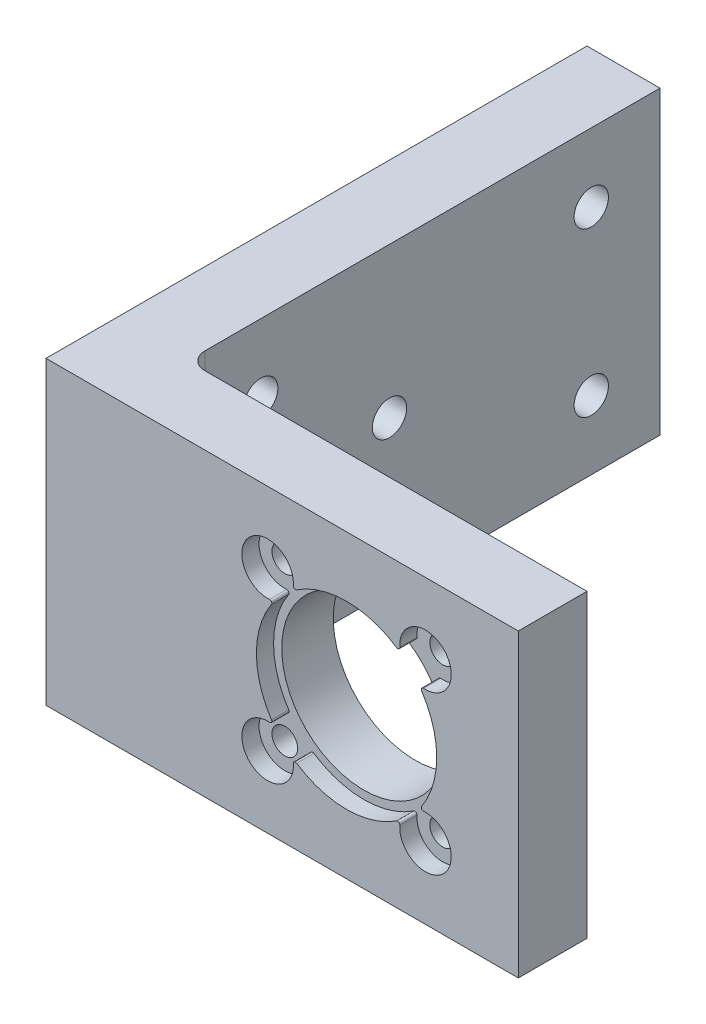
ISO-10303-21;
HEADER;
FILE_DESCRIPTION(('STEP AP214'),'2;1');
FILE_NAME('part.step','',(''),(''),'','','');
FILE_SCHEMA(('AUTOMOTIVE_DESIGN { 1 0 10303 214 1 1 1 1 }'));
ENDSEC;
DATA;
#1=APPLICATION_CONTEXT('core data for automotive mechanical design processes');
#2=APPLICATION_PROTOCOL_DEFINITION('international standard','automotive_design',2000,#1);
#3=PRODUCT_CONTEXT('',#1,'mechanical');
#4=PRODUCT('Part','Part','',(#3));
#5=PRODUCT_RELATED_PRODUCT_CATEGORY('part','',(#4));
#6=PRODUCT_DEFINITION_FORMATION('','',#4);
#7=PRODUCT_DEFINITION_CONTEXT('part definition',#1,'design');
#8=PRODUCT_DEFINITION('design','',#6,#7);
#9=PRODUCT_DEFINITION_SHAPE('','',#8);
#10=(LENGTH_UNIT() NAMED_UNIT(*) SI_UNIT(.MILLI.,.METRE.));
#11=(NAMED_UNIT(*) PLANE_ANGLE_UNIT() SI_UNIT($,.RADIAN.));
#12=(NAMED_UNIT(*) SI_UNIT($,.STERADIAN.) SOLID_ANGLE_UNIT());
#13=UNCERTAINTY_MEASURE_WITH_UNIT(LENGTH_MEASURE(1.E-05),#10,'distance_accuracy_value','');
#14=(GEOMETRIC_REPRESENTATION_CONTEXT(3) GLOBAL_UNCERTAINTY_ASSIGNED_CONTEXT((#13)) GLOBAL_UNIT_ASSIGNED_CONTEXT((#10,
#11,#12)) REPRESENTATION_CONTEXT('',''));
#15=CARTESIAN_POINT('',(0.,0.,0.));
#16=DIRECTION('',(0.,0.,1.));
#17=DIRECTION('',(1.,0.,0.));
#18=AXIS2_PLACEMENT_3D('',#15,#16,#17);
#19=CARTESIAN_POINT('',(10.5,0.,-2.));
#20=DIRECTION('',(0.,1.,0.));
#21=DIRECTION('',(-1.,0.,0.));
#22=AXIS2_PLACEMENT_3D('',#19,#20,#21);
#23=CYLINDRICAL_SURFACE('',#22,2.);
#24=DIRECTION('',(0.,1.,0.));
#25=VECTOR('',#24,1.);
#26=CARTESIAN_POINT('',(10.5,0.,0.));
#27=LINE('',#26,#25);
#28=CARTESIAN_POINT('',(10.5,0.,0.));
#29=VERTEX_POINT('',#28);
#30=CARTESIAN_POINT('',(10.5,35.,0.));
#31=VERTEX_POINT('',#30);
#32=EDGE_CURVE('E382',#29,#31,#27,.T.);
#33=ORIENTED_EDGE('',*,*,#32,.F.);
#34=CARTESIAN_POINT('',(10.5,0.,-2.));
#35=DIRECTION('',(0.,1.,0.));
#36=DIRECTION('',(-1.,0.,0.));
#37=AXIS2_PLACEMENT_3D('',#34,#35,#36);
#38=CIRCLE('',#37,2.);
#39=CARTESIAN_POINT('',(8.5,0.,-1.99999999999999));
#40=VERTEX_POINT('',#39);
#41=EDGE_CURVE('E41',#29,#40,#38,.F.);
#42=ORIENTED_EDGE('',*,*,#41,.T.);
#43=DIRECTION('',(0.,1.,0.));
#44=VECTOR('',#43,1.);
#45=CARTESIAN_POINT('',(8.5,0.,-2.));
#46=LINE('',#45,#44);
#47=CARTESIAN_POINT('',(8.5,35.,-1.99999999999999));
#48=VERTEX_POINT('',#47);
#49=EDGE_CURVE('E385',#48,#40,#46,.F.);
#50=ORIENTED_EDGE('',*,*,#49,.F.);
#51=CARTESIAN_POINT('',(10.5,35.,-2.));
#52=DIRECTION('',(0.,-1.,0.));
#53=DIRECTION('',(1.,0.,0.));
#54=AXIS2_PLACEMENT_3D('',#51,#52,#53);
#55=CIRCLE('',#54,2.);
#56=EDGE_CURVE('E11',#48,#31,#55,.F.);
#57=ORIENTED_EDGE('',*,*,#56,.T.);
#58=EDGE_LOOP('',(#33,#42,#50,#57));
#59=FACE_BOUND('',#58,.T.);
#60=ADVANCED_FACE('F34',(#59),#23,.F.);
#61=CARTESIAN_POINT('',(0.,0.,6.));
#62=DIRECTION('',(0.,0.,-1.));
#63=DIRECTION('',(-1.,0.,0.));
#64=AXIS2_PLACEMENT_3D('',#61,#62,#63);
#65=PLANE('',#64);
#66=CARTESIAN_POINT('',(25.8076118445749,26.6923881554251,6.));
#67=DIRECTION('',(0.,0.,1.));
#68=DIRECTION('',(-1.,0.,0.));
#69=AXIS2_PLACEMENT_3D('',#66,#67,#68);
#70=CIRCLE('',#69,1.5);
#71=CARTESIAN_POINT('',(24.3076118445749,26.6923881554251,6.));
#72=VERTEX_POINT('',#71);
#73=EDGE_CURVE('E337',#72,#72,#70,.T.);
#74=ORIENTED_EDGE('',*,*,#73,.F.);
#75=EDGE_LOOP('',(#74));
#76=FACE_BOUND('',#75,.T.);
#77=CARTESIAN_POINT('',(25.8076118445749,8.30761184457487,6.));
#78=DIRECTION('',(0.,0.,1.));
#79=DIRECTION('',(1.,0.,0.));
#80=AXIS2_PLACEMENT_3D('',#77,#78,#79);
#81=CIRCLE('',#80,1.5);
#82=CARTESIAN_POINT('',(27.3076118445749,8.30761184457487,6.));
#83=VERTEX_POINT('',#82);
#84=EDGE_CURVE('E343',#83,#83,#81,.T.);
#85=ORIENTED_EDGE('',*,*,#84,.F.);
#86=EDGE_LOOP('',(#85));
#87=FACE_BOUND('',#86,.T.);
#88=CARTESIAN_POINT('',(44.1923881554251,8.30761184457487,6.));
#89=DIRECTION('',(0.,0.,1.));
#90=DIRECTION('',(-1.,0.,0.));
#91=AXIS2_PLACEMENT_3D('',#88,#89,#90);
#92=CIRCLE('',#91,1.5);
#93=CARTESIAN_POINT('',(42.6923881554251,8.30761184457487,6.));
#94=VERTEX_POINT('',#93);
#95=EDGE_CURVE('E349',#94,#94,#92,.T.);
#96=ORIENTED_EDGE('',*,*,#95,.F.);
#97=EDGE_LOOP('',(#96));
#98=FACE_BOUND('',#97,.T.);
#99=CARTESIAN_POINT('',(44.1923881554251,26.6923881554251,6.));
#100=DIRECTION('',(0.,0.,1.));
#101=DIRECTION('',(1.,0.,0.));
#102=AXIS2_PLACEMENT_3D('',#99,#100,#101);
#103=CIRCLE('',#102,1.50000000000001);
#104=CARTESIAN_POINT('',(45.6923881554251,26.6923881554251,6.));
#105=VERTEX_POINT('',#104);
#106=EDGE_CURVE('E355',#105,#105,#103,.T.);
#107=ORIENTED_EDGE('',*,*,#106,.F.);
#108=EDGE_LOOP('',(#107));
#109=FACE_BOUND('',#108,.T.);
#110=CARTESIAN_POINT('',(35.,17.5,6.));
#111=DIRECTION('',(0.,0.,1.));
#112=DIRECTION('',(1.,0.,0.));
#113=AXIS2_PLACEMENT_3D('',#110,#111,#112);
#114=CIRCLE('',#113,9.55000000000002);
#115=CARTESIAN_POINT('',(44.55,17.5,6.));
#116=VERTEX_POINT('',#115);
#117=EDGE_CURVE('E361',#116,#116,#114,.T.);
#118=ORIENTED_EDGE('',*,*,#117,.F.);
#119=EDGE_LOOP('',(#118));
#120=FACE_BOUND('',#119,.T.);
#121=CARTESIAN_POINT('',(35.,17.5,6.));
#122=DIRECTION('',(0.,0.,1.));
#123=DIRECTION('',(1.,0.,0.));
#124=AXIS2_PLACEMENT_3D('',#121,#122,#123);
#125=CIRCLE('',#124,10.5);
#126=CARTESIAN_POINT('',(26.25582245514,23.3128615211415,6.));
#127=VERTEX_POINT('',#126);
#128=CARTESIAN_POINT('',(26.25582245514,11.6871384788585,6.));
#129=VERTEX_POINT('',#128);
#130=EDGE_CURVE('E217',#127,#129,#125,.T.);
#131=ORIENTED_EDGE('',*,*,#130,.T.);
#132=CARTESIAN_POINT('',(26.047627751691,11.5487370140695,6.));
#133=DIRECTION('',(0.,0.,-1.));
#134=DIRECTION('',(-1.,0.,0.));
#135=AXIS2_PLACEMENT_3D('',#132,#133,#134);
#136=CIRCLE('',#135,0.250000000000001);
#137=CARTESIAN_POINT('',(26.0291649896051,11.2994196933391,6.));
#138=VERTEX_POINT('',#137);
#139=EDGE_CURVE('E206',#129,#138,#136,.T.);
#140=ORIENTED_EDGE('',*,*,#139,.T.);
#141=CARTESIAN_POINT('',(25.8076118445749,8.30761184457488,6.));
#142=DIRECTION('',(0.,0.,1.));
#143=DIRECTION('',(-1.,0.,0.));
#144=AXIS2_PLACEMENT_3D('',#141,#142,#143);
#145=CIRCLE('',#144,3.);
#146=CARTESIAN_POINT('',(28.7994196933391,8.52916498960515,6.));
#147=VERTEX_POINT('',#146);
#148=EDGE_CURVE('E209',#138,#147,#145,.T.);
#149=ORIENTED_EDGE('',*,*,#148,.T.);
#150=CARTESIAN_POINT('',(29.0487370140695,8.547627751691,6.));
#151=DIRECTION('',(0.,0.,-1.));
#152=DIRECTION('',(1.,0.,0.));
#153=AXIS2_PLACEMENT_3D('',#150,#151,#152);
#154=CIRCLE('',#153,0.25);
#155=CARTESIAN_POINT('',(29.1871384788585,8.75582245514005,6.));
#156=VERTEX_POINT('',#155);
#157=EDGE_CURVE('E251',#147,#156,#154,.T.);
#158=ORIENTED_EDGE('',*,*,#157,.T.);
#159=CARTESIAN_POINT('',(35.,17.5,6.));
#160=DIRECTION('',(0.,0.,1.));
#161=DIRECTION('',(1.,0.,0.));
#162=AXIS2_PLACEMENT_3D('',#159,#160,#161);
#163=CIRCLE('',#162,10.5);
#164=CARTESIAN_POINT('',(40.8128615211414,8.75582245514005,6.));
#165=VERTEX_POINT('',#164);
#166=EDGE_CURVE('E254',#156,#165,#163,.T.);
#167=ORIENTED_EDGE('',*,*,#166,.T.);
#168=CARTESIAN_POINT('',(40.9512629859305,8.547627751691,6.));
#169=DIRECTION('',(0.,0.,-1.));
#170=DIRECTION('',(-1.,0.,0.));
#171=AXIS2_PLACEMENT_3D('',#168,#169,#170);
#172=CIRCLE('',#171,0.250000000000002);
#173=CARTESIAN_POINT('',(41.2005803066609,8.52916498960515,6.));
#174=VERTEX_POINT('',#173);
#175=EDGE_CURVE('E257',#165,#174,#172,.T.);
#176=ORIENTED_EDGE('',*,*,#175,.T.);
#177=CARTESIAN_POINT('',(44.1923881554251,8.30761184457488,6.));
#178=DIRECTION('',(0.,0.,1.));
#179=DIRECTION('',(1.,0.,0.));
#180=AXIS2_PLACEMENT_3D('',#177,#178,#179);
#181=CIRCLE('',#180,3.);
#182=CARTESIAN_POINT('',(43.9708350103948,11.2994196933391,6.));
#183=VERTEX_POINT('',#182);
#184=EDGE_CURVE('E260',#174,#183,#181,.T.);
#185=ORIENTED_EDGE('',*,*,#184,.T.);
#186=CARTESIAN_POINT('',(43.952372248309,11.5487370140695,6.));
#187=DIRECTION('',(0.,0.,-1.));
#188=DIRECTION('',(1.,0.,0.));
#189=AXIS2_PLACEMENT_3D('',#186,#187,#188);
#190=CIRCLE('',#189,0.25);
#191=CARTESIAN_POINT('',(43.7441775448599,11.6871384788585,6.));
#192=VERTEX_POINT('',#191);
#193=EDGE_CURVE('E263',#183,#192,#190,.T.);
#194=ORIENTED_EDGE('',*,*,#193,.T.);
#195=CARTESIAN_POINT('',(35.,17.5,6.));
#196=DIRECTION('',(0.,0.,1.));
#197=DIRECTION('',(1.,0.,0.));
#198=AXIS2_PLACEMENT_3D('',#195,#196,#197);
#199=CIRCLE('',#198,10.5);
#200=CARTESIAN_POINT('',(43.7441775448599,23.3128615211415,6.));
#201=VERTEX_POINT('',#200);
#202=EDGE_CURVE('E266',#192,#201,#199,.T.);
#203=ORIENTED_EDGE('',*,*,#202,.T.);
#204=CARTESIAN_POINT('',(43.952372248309,23.4512629859306,6.));
#205=DIRECTION('',(0.,0.,-1.));
#206=DIRECTION('',(-1.,0.,0.));
#207=AXIS2_PLACEMENT_3D('',#204,#205,#206);
#208=CIRCLE('',#207,0.249999999999999);
#209=CARTESIAN_POINT('',(43.9708350103948,23.7005803066609,6.));
#210=VERTEX_POINT('',#209);
#211=EDGE_CURVE('E269',#201,#210,#208,.T.);
#212=ORIENTED_EDGE('',*,*,#211,.T.);
#213=CARTESIAN_POINT('',(44.1923881554251,26.6923881554251,6.));
#214=DIRECTION('',(0.,0.,1.));
#215=DIRECTION('',(-1.,0.,0.));
#216=AXIS2_PLACEMENT_3D('',#213,#214,#215);
#217=CIRCLE('',#216,3.);
#218=CARTESIAN_POINT('',(41.2005803066609,26.4708350103949,6.));
#219=VERTEX_POINT('',#218);
#220=EDGE_CURVE('E272',#210,#219,#217,.T.);
#221=ORIENTED_EDGE('',*,*,#220,.T.);
#222=CARTESIAN_POINT('',(40.9512629859305,26.452372248309,6.));
#223=DIRECTION('',(0.,0.,-1.));
#224=DIRECTION('',(1.,0.,0.));
#225=AXIS2_PLACEMENT_3D('',#222,#223,#224);
#226=CIRCLE('',#225,0.250000000000002);
#227=CARTESIAN_POINT('',(40.8128615211414,26.24417754486,6.));
#228=VERTEX_POINT('',#227);
#229=EDGE_CURVE('E275',#219,#228,#226,.T.);
#230=ORIENTED_EDGE('',*,*,#229,.T.);
#231=CARTESIAN_POINT('',(35.,17.5,6.));
#232=DIRECTION('',(0.,0.,1.));
#233=DIRECTION('',(1.,0.,0.));
#234=AXIS2_PLACEMENT_3D('',#231,#232,#233);
#235=CIRCLE('',#234,10.5);
#236=CARTESIAN_POINT('',(29.1871384788585,26.24417754486,6.));
#237=VERTEX_POINT('',#236);
#238=EDGE_CURVE('E278',#228,#237,#235,.T.);
#239=ORIENTED_EDGE('',*,*,#238,.T.);
#240=CARTESIAN_POINT('',(29.0487370140695,26.452372248309,6.));
#241=DIRECTION('',(0.,0.,-1.));
#242=DIRECTION('',(-1.,0.,0.));
#243=AXIS2_PLACEMENT_3D('',#240,#241,#242);
#244=CIRCLE('',#243,0.25);
#245=CARTESIAN_POINT('',(28.7994196933391,26.4708350103949,6.));
#246=VERTEX_POINT('',#245);
#247=EDGE_CURVE('E281',#237,#246,#244,.T.);
#248=ORIENTED_EDGE('',*,*,#247,.T.);
#249=CARTESIAN_POINT('',(25.8076118445749,26.6923881554251,6.));
#250=DIRECTION('',(0.,0.,1.));
#251=DIRECTION('',(1.,0.,0.));
#252=AXIS2_PLACEMENT_3D('',#249,#250,#251);
#253=CIRCLE('',#252,3.);
#254=CARTESIAN_POINT('',(26.0291649896051,23.7005803066609,6.));
#255=VERTEX_POINT('',#254);
#256=EDGE_CURVE('E284',#246,#255,#253,.T.);
#257=ORIENTED_EDGE('',*,*,#256,.T.);
#258=CARTESIAN_POINT('',(26.047627751691,23.4512629859306,6.));
#259=DIRECTION('',(0.,0.,-1.));
#260=DIRECTION('',(1.,0.,0.));
#261=AXIS2_PLACEMENT_3D('',#258,#259,#260);
#262=CIRCLE('',#261,0.250000000000002);
#263=EDGE_CURVE('E287',#255,#127,#262,.T.);
#264=ORIENTED_EDGE('',*,*,#263,.T.);
#265=EDGE_LOOP('',(#131,#140,#149,#158,#167,#176,#185,#194,#203,#212,#221,#230,#239,#248,#257,#264));
#266=FACE_BOUND('',#265,.T.);
#267=ADVANCED_FACE('F452',(#76,#87,#98,#109,#120,#266),#65,.F.);
#268=CARTESIAN_POINT('',(0.,0.,0.));
#269=DIRECTION('',(0.,0.,-1.));
#270=DIRECTION('',(-1.,0.,0.));
#271=AXIS2_PLACEMENT_3D('',#268,#269,#270);
#272=PLANE('',#271);
#273=DIRECTION('',(1.,0.,0.));
#274=VECTOR('',#273,1.);
#275=CARTESIAN_POINT('',(0.,0.,0.));
#276=LINE('',#275,#274);
#277=CARTESIAN_POINT('',(55.,0.,0.));
#278=VERTEX_POINT('',#277);
#279=EDGE_CURVE('E364',#29,#278,#276,.T.);
#280=ORIENTED_EDGE('',*,*,#279,.F.);
#281=ORIENTED_EDGE('',*,*,#32,.T.);
#282=DIRECTION('',(-1.,0.,0.));
#283=VECTOR('',#282,1.);
#284=CARTESIAN_POINT('',(0.,35.,0.));
#285=LINE('',#284,#283);
#286=CARTESIAN_POINT('',(55.,35.,0.));
#287=VERTEX_POINT('',#286);
#288=EDGE_CURVE('E370',#287,#31,#285,.T.);
#289=ORIENTED_EDGE('',*,*,#288,.F.);
#290=DIRECTION('',(0.,1.,0.));
#291=VECTOR('',#290,1.);
#292=CARTESIAN_POINT('',(55.,0.,0.));
#293=LINE('',#292,#291);
#294=EDGE_CURVE('E368',#278,#287,#293,.T.);
#295=ORIENTED_EDGE('',*,*,#294,.F.);
#296=EDGE_LOOP('',(#280,#281,#289,#295));
#297=FACE_BOUND('',#296,.T.);
#298=CARTESIAN_POINT('',(25.8076118445749,8.30761184457487,0.));
#299=DIRECTION('',(0.,0.,1.));
#300=DIRECTION('',(1.,0.,0.));
#301=AXIS2_PLACEMENT_3D('',#298,#299,#300);
#302=CIRCLE('',#301,1.5);
#303=CARTESIAN_POINT('',(27.3076118445749,8.30761184457487,0.));
#304=VERTEX_POINT('',#303);
#305=EDGE_CURVE('E340',#304,#304,#302,.T.);
#306=ORIENTED_EDGE('',*,*,#305,.T.);
#307=EDGE_LOOP('',(#306));
#308=FACE_BOUND('',#307,.T.);
#309=CARTESIAN_POINT('',(44.1923881554251,26.6923881554251,0.));
#310=DIRECTION('',(0.,0.,1.));
#311=DIRECTION('',(1.,0.,0.));
#312=AXIS2_PLACEMENT_3D('',#309,#310,#311);
#313=CIRCLE('',#312,1.50000000000001);
#314=CARTESIAN_POINT('',(45.6923881554251,26.6923881554251,0.));
#315=VERTEX_POINT('',#314);
#316=EDGE_CURVE('E352',#315,#315,#313,.T.);
#317=ORIENTED_EDGE('',*,*,#316,.T.);
#318=EDGE_LOOP('',(#317));
#319=FACE_BOUND('',#318,.T.);
#320=CARTESIAN_POINT('',(35.,17.5,0.));
#321=DIRECTION('',(0.,0.,1.));
#322=DIRECTION('',(1.,0.,0.));
#323=AXIS2_PLACEMENT_3D('',#320,#321,#322);
#324=CIRCLE('',#323,9.55000000000002);
#325=CARTESIAN_POINT('',(44.55,17.5,0.));
#326=VERTEX_POINT('',#325);
#327=EDGE_CURVE('E358',#326,#326,#324,.T.);
#328=ORIENTED_EDGE('',*,*,#327,.T.);
#329=EDGE_LOOP('',(#328));
#330=FACE_BOUND('',#329,.T.);
#331=CARTESIAN_POINT('',(44.1923881554251,8.30761184457487,0.));
#332=DIRECTION('',(0.,0.,1.));
#333=DIRECTION('',(-1.,0.,0.));
#334=AXIS2_PLACEMENT_3D('',#331,#332,#333);
#335=CIRCLE('',#334,1.5);
#336=CARTESIAN_POINT('',(42.6923881554251,8.30761184457487,0.));
#337=VERTEX_POINT('',#336);
#338=EDGE_CURVE('E346',#337,#337,#335,.T.);
#339=ORIENTED_EDGE('',*,*,#338,.T.);
#340=EDGE_LOOP('',(#339));
#341=FACE_BOUND('',#340,.T.);
#342=CARTESIAN_POINT('',(25.8076118445749,26.6923881554251,0.));
#343=DIRECTION('',(0.,0.,1.));
#344=DIRECTION('',(-1.,0.,0.));
#345=AXIS2_PLACEMENT_3D('',#342,#343,#344);
#346=CIRCLE('',#345,1.5);
#347=CARTESIAN_POINT('',(24.3076118445749,26.6923881554251,0.));
#348=VERTEX_POINT('',#347);
#349=EDGE_CURVE('E336',#348,#348,#346,.T.);
#350=ORIENTED_EDGE('',*,*,#349,.T.);
#351=EDGE_LOOP('',(#350));
#352=FACE_BOUND('',#351,.T.);
#353=ADVANCED_FACE('F434',(#297,#308,#319,#330,#341,#352),#272,.T.);
#354=CARTESIAN_POINT('',(0.,0.,6.));
#355=DIRECTION('',(1.,0.,0.));
#356=DIRECTION('',(0.,1.,0.));
#357=AXIS2_PLACEMENT_3D('',#354,#355,#356);
#358=PLANE('',#357);
#359=CARTESIAN_POINT('',(0.,8.00000000000002,-8.49999999999999));
#360=DIRECTION('',(-1.,0.,0.));
#361=DIRECTION('',(0.,1.,0.));
#362=AXIS2_PLACEMENT_3D('',#359,#360,#361);
#363=CIRCLE('',#362,2.);
#364=CARTESIAN_POINT('',(0.,10.,-8.49999999999999));
#365=VERTEX_POINT('',#364);
#366=EDGE_CURVE('E397',#365,#365,#363,.T.);
#367=ORIENTED_EDGE('',*,*,#366,.F.);
#368=EDGE_LOOP('',(#367));
#369=FACE_BOUND('',#368,.T.);
#370=CARTESIAN_POINT('',(0.,27.,-8.49999999999999));
#371=DIRECTION('',(-1.,0.,0.));
#372=DIRECTION('',(0.,-1.,0.));
#373=AXIS2_PLACEMENT_3D('',#370,#371,#372);
#374=CIRCLE('',#373,2.);
#375=CARTESIAN_POINT('',(0.,25.,-8.49999999999999));
#376=VERTEX_POINT('',#375);
#377=EDGE_CURVE('E403',#376,#376,#374,.T.);
#378=ORIENTED_EDGE('',*,*,#377,.F.);
#379=EDGE_LOOP('',(#378));
#380=FACE_BOUND('',#379,.T.);
#381=CARTESIAN_POINT('',(0.,8.00000000000001,-47.));
#382=DIRECTION('',(-1.,0.,0.));
#383=DIRECTION('',(0.,1.,0.));
#384=AXIS2_PLACEMENT_3D('',#381,#382,#383);
#385=CIRCLE('',#384,2.);
#386=CARTESIAN_POINT('',(0.,10.,-47.));
#387=VERTEX_POINT('',#386);
#388=EDGE_CURVE('E409',#387,#387,#385,.T.);
#389=ORIENTED_EDGE('',*,*,#388,.F.);
#390=EDGE_LOOP('',(#389));
#391=FACE_BOUND('',#390,.T.);
#392=CARTESIAN_POINT('',(0.,17.5,-23.5));
#393=DIRECTION('',(-1.,0.,0.));
#394=DIRECTION('',(0.,-1.,0.));
#395=AXIS2_PLACEMENT_3D('',#392,#393,#394);
#396=CIRCLE('',#395,2.);
#397=CARTESIAN_POINT('',(0.,15.5,-23.5));
#398=VERTEX_POINT('',#397);
#399=EDGE_CURVE('E415',#398,#398,#396,.T.);
#400=ORIENTED_EDGE('',*,*,#399,.F.);
#401=EDGE_LOOP('',(#400));
#402=FACE_BOUND('',#401,.T.);
#403=CARTESIAN_POINT('',(0.,27.,-47.));
#404=DIRECTION('',(-1.,0.,0.));
#405=DIRECTION('',(0.,-1.,0.));
#406=AXIS2_PLACEMENT_3D('',#403,#404,#405);
#407=CIRCLE('',#406,2.);
#408=CARTESIAN_POINT('',(0.,25.,-47.));
#409=VERTEX_POINT('',#408);
#410=EDGE_CURVE('E391',#409,#409,#407,.T.);
#411=ORIENTED_EDGE('',*,*,#410,.F.);
#412=EDGE_LOOP('',(#411));
#413=FACE_BOUND('',#412,.T.);
#414=DIRECTION('',(0.,0.,-1.));
#415=VECTOR('',#414,1.);
#416=CARTESIAN_POINT('',(0.,35.,6.));
#417=LINE('',#416,#415);
#418=CARTESIAN_POINT('',(0.,35.,8.));
#419=VERTEX_POINT('',#418);
#420=CARTESIAN_POINT('',(0.,35.,-55.));
#421=VERTEX_POINT('',#420);
#422=EDGE_CURVE('E372',#419,#421,#417,.T.);
#423=ORIENTED_EDGE('',*,*,#422,.T.);
#424=DIRECTION('',(0.,1.,0.));
#425=VECTOR('',#424,1.);
#426=CARTESIAN_POINT('',(0.,0.,-55.));
#427=LINE('',#426,#425);
#428=CARTESIAN_POINT('',(0.,0.,-55.));
#429=VERTEX_POINT('',#428);
#430=EDGE_CURVE('E202',#429,#421,#427,.T.);
#431=ORIENTED_EDGE('',*,*,#430,.F.);
#432=DIRECTION('',(0.,0.,-1.));
#433=VECTOR('',#432,1.);
#434=CARTESIAN_POINT('',(0.,0.,6.));
#435=LINE('',#434,#433);
#436=CARTESIAN_POINT('',(0.,0.,8.));
#437=VERTEX_POINT('',#436);
#438=EDGE_CURVE('E380',#437,#429,#435,.T.);
#439=ORIENTED_EDGE('',*,*,#438,.F.);
#440=DIRECTION('',(0.,-1.,0.));
#441=VECTOR('',#440,1.);
#442=CARTESIAN_POINT('',(0.,35.,8.));
#443=LINE('',#442,#441);
#444=EDGE_CURVE('E324',#419,#437,#443,.T.);
#445=ORIENTED_EDGE('',*,*,#444,.F.);
#446=EDGE_LOOP('',(#423,#431,#439,#445));
#447=FACE_BOUND('',#446,.T.);
#448=ADVANCED_FACE('F431',(#369,#380,#391,#402,#413,#447),#358,.F.);
#449=CARTESIAN_POINT('',(0.,0.,6.));
#450=DIRECTION('',(0.,1.,0.));
#451=DIRECTION('',(-1.,0.,0.));
#452=AXIS2_PLACEMENT_3D('',#449,#450,#451);
#453=PLANE('',#452);
#454=ORIENTED_EDGE('',*,*,#41,.F.);
#455=ORIENTED_EDGE('',*,*,#279,.T.);
#456=DIRECTION('',(0.,0.,-1.));
#457=VECTOR('',#456,1.);
#458=CARTESIAN_POINT('',(55.,0.,6.));
#459=LINE('',#458,#457);
#460=CARTESIAN_POINT('',(55.,0.,8.));
#461=VERTEX_POINT('',#460);
#462=EDGE_CURVE('E377',#461,#278,#459,.T.);
#463=ORIENTED_EDGE('',*,*,#462,.F.);
#464=DIRECTION('',(1.,0.,0.));
#465=VECTOR('',#464,1.);
#466=CARTESIAN_POINT('',(0.,0.,8.));
#467=LINE('',#466,#465);
#468=EDGE_CURVE('E327',#437,#461,#467,.T.);
#469=ORIENTED_EDGE('',*,*,#468,.F.);
#470=ORIENTED_EDGE('',*,*,#438,.T.);
#471=DIRECTION('',(-1.,0.,0.));
#472=VECTOR('',#471,1.);
#473=CARTESIAN_POINT('',(0.,0.,-55.));
#474=LINE('',#473,#472);
#475=CARTESIAN_POINT('',(8.5,0.,-55.));
#476=VERTEX_POINT('',#475);
#477=EDGE_CURVE('E195',#476,#429,#474,.T.);
#478=ORIENTED_EDGE('',*,*,#477,.F.);
#479=DIRECTION('',(0.,0.,1.));
#480=VECTOR('',#479,1.);
#481=CARTESIAN_POINT('',(8.5,0.,-55.));
#482=LINE('',#481,#480);
#483=EDGE_CURVE('E191',#476,#40,#482,.T.);
#484=ORIENTED_EDGE('',*,*,#483,.T.);
#485=EDGE_LOOP('',(#454,#455,#463,#469,#470,#478,#484));
#486=FACE_BOUND('',#485,.T.);
#487=ADVANCED_FACE('F387',(#486),#453,.F.);
#488=CARTESIAN_POINT('',(55.,0.,6.));
#489=DIRECTION('',(-1.,0.,0.));
#490=DIRECTION('',(0.,0.,1.));
#491=AXIS2_PLACEMENT_3D('',#488,#489,#490);
#492=PLANE('',#491);
#493=ORIENTED_EDGE('',*,*,#294,.T.);
#494=DIRECTION('',(0.,0.,-1.));
#495=VECTOR('',#494,1.);
#496=CARTESIAN_POINT('',(55.,35.,6.));
#497=LINE('',#496,#495);
#498=CARTESIAN_POINT('',(55.,35.,8.));
#499=VERTEX_POINT('',#498);
#500=EDGE_CURVE('E374',#499,#287,#497,.T.);
#501=ORIENTED_EDGE('',*,*,#500,.F.);
#502=DIRECTION('',(0.,1.,0.));
#503=VECTOR('',#502,1.);
#504=CARTESIAN_POINT('',(55.,35.,8.));
#505=LINE('',#504,#503);
#506=EDGE_CURVE('E330',#461,#499,#505,.T.);
#507=ORIENTED_EDGE('',*,*,#506,.F.);
#508=ORIENTED_EDGE('',*,*,#462,.T.);
#509=EDGE_LOOP('',(#493,#501,#507,#508));
#510=FACE_BOUND('',#509,.T.);
#511=ADVANCED_FACE('F445',(#510),#492,.F.);
#512=CARTESIAN_POINT('',(0.,35.,6.));
#513=DIRECTION('',(0.,-1.,0.));
#514=DIRECTION('',(1.,0.,0.));
#515=AXIS2_PLACEMENT_3D('',#512,#513,#514);
#516=PLANE('',#515);
#517=ORIENTED_EDGE('',*,*,#288,.T.);
#518=ORIENTED_EDGE('',*,*,#56,.F.);
#519=DIRECTION('',(0.,0.,1.));
#520=VECTOR('',#519,1.);
#521=CARTESIAN_POINT('',(8.5,35.,-55.));
#522=LINE('',#521,#520);
#523=CARTESIAN_POINT('',(8.5,35.,-55.));
#524=VERTEX_POINT('',#523);
#525=EDGE_CURVE('E189',#524,#48,#522,.T.);
#526=ORIENTED_EDGE('',*,*,#525,.F.);
#527=DIRECTION('',(1.,0.,0.));
#528=VECTOR('',#527,1.);
#529=CARTESIAN_POINT('',(0.,35.,-55.));
#530=LINE('',#529,#528);
#531=EDGE_CURVE('E196',#421,#524,#530,.T.);
#532=ORIENTED_EDGE('',*,*,#531,.F.);
#533=ORIENTED_EDGE('',*,*,#422,.F.);
#534=DIRECTION('',(-1.,0.,0.));
#535=VECTOR('',#534,1.);
#536=CARTESIAN_POINT('',(0.,35.,8.));
#537=LINE('',#536,#535);
#538=EDGE_CURVE('E333',#499,#419,#537,.T.);
#539=ORIENTED_EDGE('',*,*,#538,.F.);
#540=ORIENTED_EDGE('',*,*,#500,.T.);
#541=EDGE_LOOP('',(#517,#518,#526,#532,#533,#539,#540));
#542=FACE_BOUND('',#541,.T.);
#543=ADVANCED_FACE('F205',(#542),#516,.F.);
#544=CARTESIAN_POINT('',(35.,17.5,6.));
#545=DIRECTION('',(0.,0.,-1.));
#546=DIRECTION('',(-1.,0.,0.));
#547=AXIS2_PLACEMENT_3D('',#544,#545,#546);
#548=CYLINDRICAL_SURFACE('',#547,9.55000000000002);
#549=ORIENTED_EDGE('',*,*,#117,.T.);
#550=EDGE_LOOP('',(#549));
#551=FACE_BOUND('',#550,.T.);
#552=ORIENTED_EDGE('',*,*,#327,.F.);
#553=EDGE_LOOP('',(#552));
#554=FACE_BOUND('',#553,.T.);
#555=ADVANCED_FACE('F465',(#551,#554),#548,.F.);
#556=CARTESIAN_POINT('',(44.1923881554251,26.6923881554251,6.));
#557=DIRECTION('',(0.,0.,-1.));
#558=DIRECTION('',(-1.,0.,0.));
#559=AXIS2_PLACEMENT_3D('',#556,#557,#558);
#560=CYLINDRICAL_SURFACE('',#559,1.50000000000001);
#561=ORIENTED_EDGE('',*,*,#106,.T.);
#562=EDGE_LOOP('',(#561));
#563=FACE_BOUND('',#562,.T.);
#564=ORIENTED_EDGE('',*,*,#316,.F.);
#565=EDGE_LOOP('',(#564));
#566=FACE_BOUND('',#565,.T.);
#567=ADVANCED_FACE('F494',(#563,#566),#560,.F.);
#568=CARTESIAN_POINT('',(44.1923881554251,8.30761184457487,6.));
#569=DIRECTION('',(0.,0.,-1.));
#570=DIRECTION('',(-1.,0.,0.));
#571=AXIS2_PLACEMENT_3D('',#568,#569,#570);
#572=CYLINDRICAL_SURFACE('',#571,1.5);
#573=ORIENTED_EDGE('',*,*,#95,.T.);
#574=EDGE_LOOP('',(#573));
#575=FACE_BOUND('',#574,.T.);
#576=ORIENTED_EDGE('',*,*,#338,.F.);
#577=EDGE_LOOP('',(#576));
#578=FACE_BOUND('',#577,.T.);
#579=ADVANCED_FACE('F501',(#575,#578),#572,.F.);
#580=CARTESIAN_POINT('',(25.8076118445749,8.30761184457487,6.));
#581=DIRECTION('',(0.,0.,-1.));
#582=DIRECTION('',(-1.,0.,0.));
#583=AXIS2_PLACEMENT_3D('',#580,#581,#582);
#584=CYLINDRICAL_SURFACE('',#583,1.5);
#585=ORIENTED_EDGE('',*,*,#84,.T.);
#586=EDGE_LOOP('',(#585));
#587=FACE_BOUND('',#586,.T.);
#588=ORIENTED_EDGE('',*,*,#305,.F.);
#589=EDGE_LOOP('',(#588));
#590=FACE_BOUND('',#589,.T.);
#591=ADVANCED_FACE('F508',(#587,#590),#584,.F.);
#592=CARTESIAN_POINT('',(25.8076118445749,26.6923881554251,6.));
#593=DIRECTION('',(0.,0.,-1.));
#594=DIRECTION('',(-1.,0.,0.));
#595=AXIS2_PLACEMENT_3D('',#592,#593,#594);
#596=CYLINDRICAL_SURFACE('',#595,1.5);
#597=ORIENTED_EDGE('',*,*,#73,.T.);
#598=EDGE_LOOP('',(#597));
#599=FACE_BOUND('',#598,.T.);
#600=ORIENTED_EDGE('',*,*,#349,.F.);
#601=EDGE_LOOP('',(#600));
#602=FACE_BOUND('',#601,.T.);
#603=ADVANCED_FACE('F516',(#599,#602),#596,.F.);
#604=CARTESIAN_POINT('',(0.,0.,8.));
#605=DIRECTION('',(0.,0.,1.));
#606=DIRECTION('',(1.,0.,0.));
#607=AXIS2_PLACEMENT_3D('',#604,#605,#606);
#608=PLANE('',#607);
#609=ORIENTED_EDGE('',*,*,#444,.T.);
#610=ORIENTED_EDGE('',*,*,#468,.T.);
#611=ORIENTED_EDGE('',*,*,#506,.T.);
#612=ORIENTED_EDGE('',*,*,#538,.T.);
#613=EDGE_LOOP('',(#609,#610,#611,#612));
#614=FACE_BOUND('',#613,.T.);
#615=CARTESIAN_POINT('',(25.8076118445749,8.30761184457488,8.));
#616=DIRECTION('',(0.,0.,1.));
#617=DIRECTION('',(-1.,0.,0.));
#618=AXIS2_PLACEMENT_3D('',#615,#616,#617);
#619=CIRCLE('',#618,3.);
#620=CARTESIAN_POINT('',(26.0291649896051,11.2994196933391,8.));
#621=VERTEX_POINT('',#620);
#622=CARTESIAN_POINT('',(28.7994196933391,8.52916498960515,8.));
#623=VERTEX_POINT('',#622);
#624=EDGE_CURVE('E216',#621,#623,#619,.T.);
#625=ORIENTED_EDGE('',*,*,#624,.F.);
#626=CARTESIAN_POINT('',(26.047627751691,11.5487370140695,8.));
#627=DIRECTION('',(0.,0.,-1.));
#628=DIRECTION('',(-1.,0.,0.));
#629=AXIS2_PLACEMENT_3D('',#626,#627,#628);
#630=CIRCLE('',#629,0.250000000000001);
#631=CARTESIAN_POINT('',(26.25582245514,11.6871384788585,8.));
#632=VERTEX_POINT('',#631);
#633=EDGE_CURVE('E214',#632,#621,#630,.T.);
#634=ORIENTED_EDGE('',*,*,#633,.F.);
#635=CARTESIAN_POINT('',(35.,17.5,8.));
#636=DIRECTION('',(0.,0.,1.));
#637=DIRECTION('',(1.,0.,0.));
#638=AXIS2_PLACEMENT_3D('',#635,#636,#637);
#639=CIRCLE('',#638,10.5);
#640=CARTESIAN_POINT('',(26.25582245514,23.3128615211415,8.));
#641=VERTEX_POINT('',#640);
#642=EDGE_CURVE('E246',#641,#632,#639,.T.);
#643=ORIENTED_EDGE('',*,*,#642,.F.);
#644=CARTESIAN_POINT('',(26.047627751691,23.4512629859306,8.));
#645=DIRECTION('',(0.,0.,-1.));
#646=DIRECTION('',(1.,0.,0.));
#647=AXIS2_PLACEMENT_3D('',#644,#645,#646);
#648=CIRCLE('',#647,0.250000000000002);
#649=CARTESIAN_POINT('',(26.0291649896051,23.7005803066609,8.));
#650=VERTEX_POINT('',#649);
#651=EDGE_CURVE('E243',#650,#641,#648,.T.);
#652=ORIENTED_EDGE('',*,*,#651,.F.);
#653=CARTESIAN_POINT('',(25.8076118445749,26.6923881554251,8.));
#654=DIRECTION('',(0.,0.,1.));
#655=DIRECTION('',(1.,0.,0.));
#656=AXIS2_PLACEMENT_3D('',#653,#654,#655);
#657=CIRCLE('',#656,3.);
#658=CARTESIAN_POINT('',(28.7994196933391,26.4708350103949,8.));
#659=VERTEX_POINT('',#658);
#660=EDGE_CURVE('E241',#659,#650,#657,.T.);
#661=ORIENTED_EDGE('',*,*,#660,.F.);
#662=CARTESIAN_POINT('',(29.0487370140695,26.452372248309,8.));
#663=DIRECTION('',(0.,0.,-1.));
#664=DIRECTION('',(-1.,0.,0.));
#665=AXIS2_PLACEMENT_3D('',#662,#663,#664);
#666=CIRCLE('',#665,0.25);
#667=CARTESIAN_POINT('',(29.1871384788585,26.24417754486,8.));
#668=VERTEX_POINT('',#667);
#669=EDGE_CURVE('E239',#668,#659,#666,.T.);
#670=ORIENTED_EDGE('',*,*,#669,.F.);
#671=CARTESIAN_POINT('',(35.,17.5,8.));
#672=DIRECTION('',(0.,0.,1.));
#673=DIRECTION('',(1.,0.,0.));
#674=AXIS2_PLACEMENT_3D('',#671,#672,#673);
#675=CIRCLE('',#674,10.5);
#676=CARTESIAN_POINT('',(40.8128615211414,26.24417754486,8.));
#677=VERTEX_POINT('',#676);
#678=EDGE_CURVE('E237',#677,#668,#675,.T.);
#679=ORIENTED_EDGE('',*,*,#678,.F.);
#680=CARTESIAN_POINT('',(40.9512629859305,26.452372248309,8.));
#681=DIRECTION('',(0.,0.,-1.));
#682=DIRECTION('',(1.,0.,0.));
#683=AXIS2_PLACEMENT_3D('',#680,#681,#682);
#684=CIRCLE('',#683,0.250000000000002);
#685=CARTESIAN_POINT('',(41.2005803066609,26.4708350103949,8.));
#686=VERTEX_POINT('',#685);
#687=EDGE_CURVE('E235',#686,#677,#684,.T.);
#688=ORIENTED_EDGE('',*,*,#687,.F.);
#689=CARTESIAN_POINT('',(44.1923881554251,26.6923881554251,8.));
#690=DIRECTION('',(0.,0.,1.));
#691=DIRECTION('',(-1.,0.,0.));
#692=AXIS2_PLACEMENT_3D('',#689,#690,#691);
#693=CIRCLE('',#692,3.);
#694=CARTESIAN_POINT('',(43.9708350103948,23.7005803066609,8.));
#695=VERTEX_POINT('',#694);
#696=EDGE_CURVE('E233',#695,#686,#693,.T.);
#697=ORIENTED_EDGE('',*,*,#696,.F.);
#698=CARTESIAN_POINT('',(43.952372248309,23.4512629859306,8.));
#699=DIRECTION('',(0.,0.,-1.));
#700=DIRECTION('',(-1.,0.,0.));
#701=AXIS2_PLACEMENT_3D('',#698,#699,#700);
#702=CIRCLE('',#701,0.249999999999999);
#703=CARTESIAN_POINT('',(43.7441775448599,23.3128615211415,8.));
#704=VERTEX_POINT('',#703);
#705=EDGE_CURVE('E231',#704,#695,#702,.T.);
#706=ORIENTED_EDGE('',*,*,#705,.F.);
#707=CARTESIAN_POINT('',(35.,17.5,8.));
#708=DIRECTION('',(0.,0.,1.));
#709=DIRECTION('',(1.,0.,0.));
#710=AXIS2_PLACEMENT_3D('',#707,#708,#709);
#711=CIRCLE('',#710,10.5);
#712=CARTESIAN_POINT('',(43.7441775448599,11.6871384788585,8.));
#713=VERTEX_POINT('',#712);
#714=EDGE_CURVE('E229',#713,#704,#711,.T.);
#715=ORIENTED_EDGE('',*,*,#714,.F.);
#716=CARTESIAN_POINT('',(43.952372248309,11.5487370140695,8.));
#717=DIRECTION('',(0.,0.,-1.));
#718=DIRECTION('',(1.,0.,0.));
#719=AXIS2_PLACEMENT_3D('',#716,#717,#718);
#720=CIRCLE('',#719,0.25);
#721=CARTESIAN_POINT('',(43.9708350103948,11.2994196933391,8.));
#722=VERTEX_POINT('',#721);
#723=EDGE_CURVE('E227',#722,#713,#720,.T.);
#724=ORIENTED_EDGE('',*,*,#723,.F.);
#725=CARTESIAN_POINT('',(44.1923881554251,8.30761184457488,8.));
#726=DIRECTION('',(0.,0.,1.));
#727=DIRECTION('',(1.,0.,0.));
#728=AXIS2_PLACEMENT_3D('',#725,#726,#727);
#729=CIRCLE('',#728,3.);
#730=CARTESIAN_POINT('',(41.2005803066609,8.52916498960515,8.));
#731=VERTEX_POINT('',#730);
#732=EDGE_CURVE('E225',#731,#722,#729,.T.);
#733=ORIENTED_EDGE('',*,*,#732,.F.);
#734=CARTESIAN_POINT('',(40.9512629859305,8.547627751691,8.));
#735=DIRECTION('',(0.,0.,-1.));
#736=DIRECTION('',(-1.,0.,0.));
#737=AXIS2_PLACEMENT_3D('',#734,#735,#736);
#738=CIRCLE('',#737,0.250000000000002);
#739=CARTESIAN_POINT('',(40.8128615211414,8.75582245514005,8.));
#740=VERTEX_POINT('',#739);
#741=EDGE_CURVE('E223',#740,#731,#738,.T.);
#742=ORIENTED_EDGE('',*,*,#741,.F.);
#743=CARTESIAN_POINT('',(35.,17.5,8.));
#744=DIRECTION('',(0.,0.,1.));
#745=DIRECTION('',(1.,0.,0.));
#746=AXIS2_PLACEMENT_3D('',#743,#744,#745);
#747=CIRCLE('',#746,10.5);
#748=CARTESIAN_POINT('',(29.1871384788585,8.75582245514005,8.));
#749=VERTEX_POINT('',#748);
#750=EDGE_CURVE('E221',#749,#740,#747,.T.);
#751=ORIENTED_EDGE('',*,*,#750,.F.);
#752=CARTESIAN_POINT('',(29.0487370140695,8.547627751691,8.));
#753=DIRECTION('',(0.,0.,-1.));
#754=DIRECTION('',(1.,0.,0.));
#755=AXIS2_PLACEMENT_3D('',#752,#753,#754);
#756=CIRCLE('',#755,0.25);
#757=EDGE_CURVE('E219',#623,#749,#756,.T.);
#758=ORIENTED_EDGE('',*,*,#757,.F.);
#759=EDGE_LOOP('',(#625,#634,#643,#652,#661,#670,#679,#688,#697,#706,#715,#724,#733,#742,#751,#758));
#760=FACE_BOUND('',#759,.T.);
#761=ADVANCED_FACE('F441',(#614,#760),#608,.T.);
#762=CARTESIAN_POINT('',(26.047627751691,11.5487370140695,8.));
#763=DIRECTION('',(0.,0.,-1.));
#764=DIRECTION('',(-1.,0.,0.));
#765=AXIS2_PLACEMENT_3D('',#762,#763,#764);
#766=CYLINDRICAL_SURFACE('',#765,0.250000000000001);
#767=ORIENTED_EDGE('',*,*,#139,.F.);
#768=DIRECTION('',(0.,0.,-1.));
#769=VECTOR('',#768,1.);
#770=CARTESIAN_POINT('',(26.25582245514,11.6871384788585,8.));
#771=LINE('',#770,#769);
#772=EDGE_CURVE('E247',#632,#129,#771,.T.);
#773=ORIENTED_EDGE('',*,*,#772,.F.);
#774=ORIENTED_EDGE('',*,*,#633,.T.);
#775=DIRECTION('',(0.,0.,-1.));
#776=VECTOR('',#775,1.);
#777=CARTESIAN_POINT('',(26.0291649896051,11.2994196933391,8.));
#778=LINE('',#777,#776);
#779=EDGE_CURVE('E321',#621,#138,#778,.T.);
#780=ORIENTED_EDGE('',*,*,#779,.T.);
#781=EDGE_LOOP('',(#767,#773,#774,#780));
#782=FACE_BOUND('',#781,.T.);
#783=ADVANCED_FACE('F530',(#782),#766,.T.);
#784=CARTESIAN_POINT('',(25.8076118445749,8.30761184457488,8.));
#785=DIRECTION('',(0.,0.,-1.));
#786=DIRECTION('',(-1.,0.,0.));
#787=AXIS2_PLACEMENT_3D('',#784,#785,#786);
#788=CYLINDRICAL_SURFACE('',#787,3.);
#789=ORIENTED_EDGE('',*,*,#148,.F.);
#790=ORIENTED_EDGE('',*,*,#779,.F.);
#791=ORIENTED_EDGE('',*,*,#624,.T.);
#792=DIRECTION('',(0.,0.,-1.));
#793=VECTOR('',#792,1.);
#794=CARTESIAN_POINT('',(28.7994196933391,8.52916498960515,8.));
#795=LINE('',#794,#793);
#796=EDGE_CURVE('E319',#623,#147,#795,.T.);
#797=ORIENTED_EDGE('',*,*,#796,.T.);
#798=EDGE_LOOP('',(#789,#790,#791,#797));
#799=FACE_BOUND('',#798,.T.);
#800=ADVANCED_FACE('F537',(#799),#788,.F.);
#801=CARTESIAN_POINT('',(29.0487370140695,8.547627751691,8.));
#802=DIRECTION('',(0.,0.,-1.));
#803=DIRECTION('',(-1.,0.,0.));
#804=AXIS2_PLACEMENT_3D('',#801,#802,#803);
#805=CYLINDRICAL_SURFACE('',#804,0.25);
#806=ORIENTED_EDGE('',*,*,#157,.F.);
#807=ORIENTED_EDGE('',*,*,#796,.F.);
#808=ORIENTED_EDGE('',*,*,#757,.T.);
#809=DIRECTION('',(0.,0.,-1.));
#810=VECTOR('',#809,1.);
#811=CARTESIAN_POINT('',(29.1871384788585,8.75582245514005,8.));
#812=LINE('',#811,#810);
#813=EDGE_CURVE('E317',#749,#156,#812,.T.);
#814=ORIENTED_EDGE('',*,*,#813,.T.);
#815=EDGE_LOOP('',(#806,#807,#808,#814));
#816=FACE_BOUND('',#815,.T.);
#817=ADVANCED_FACE('F545',(#816),#805,.T.);
#818=CARTESIAN_POINT('',(35.,17.5,8.));
#819=DIRECTION('',(0.,0.,-1.));
#820=DIRECTION('',(-1.,0.,0.));
#821=AXIS2_PLACEMENT_3D('',#818,#819,#820);
#822=CYLINDRICAL_SURFACE('',#821,10.5);
#823=ORIENTED_EDGE('',*,*,#166,.F.);
#824=ORIENTED_EDGE('',*,*,#813,.F.);
#825=ORIENTED_EDGE('',*,*,#750,.T.);
#826=DIRECTION('',(0.,0.,-1.));
#827=VECTOR('',#826,1.);
#828=CARTESIAN_POINT('',(40.8128615211414,8.75582245514005,8.));
#829=LINE('',#828,#827);
#830=EDGE_CURVE('E315',#740,#165,#829,.T.);
#831=ORIENTED_EDGE('',*,*,#830,.T.);
#832=EDGE_LOOP('',(#823,#824,#825,#831));
#833=FACE_BOUND('',#832,.T.);
#834=ADVANCED_FACE('F553',(#833),#822,.F.);
#835=CARTESIAN_POINT('',(40.9512629859305,8.547627751691,8.));
#836=DIRECTION('',(0.,0.,-1.));
#837=DIRECTION('',(-1.,0.,0.));
#838=AXIS2_PLACEMENT_3D('',#835,#836,#837);
#839=CYLINDRICAL_SURFACE('',#838,0.250000000000002);
#840=ORIENTED_EDGE('',*,*,#175,.F.);
#841=ORIENTED_EDGE('',*,*,#830,.F.);
#842=ORIENTED_EDGE('',*,*,#741,.T.);
#843=DIRECTION('',(0.,0.,-1.));
#844=VECTOR('',#843,1.);
#845=CARTESIAN_POINT('',(41.2005803066609,8.52916498960515,8.));
#846=LINE('',#845,#844);
#847=EDGE_CURVE('E313',#731,#174,#846,.T.);
#848=ORIENTED_EDGE('',*,*,#847,.T.);
#849=EDGE_LOOP('',(#840,#841,#842,#848));
#850=FACE_BOUND('',#849,.T.);
#851=ADVANCED_FACE('F561',(#850),#839,.T.);
#852=CARTESIAN_POINT('',(44.1923881554251,8.30761184457488,8.));
#853=DIRECTION('',(0.,0.,-1.));
#854=DIRECTION('',(-1.,0.,0.));
#855=AXIS2_PLACEMENT_3D('',#852,#853,#854);
#856=CYLINDRICAL_SURFACE('',#855,3.);
#857=ORIENTED_EDGE('',*,*,#184,.F.);
#858=ORIENTED_EDGE('',*,*,#847,.F.);
#859=ORIENTED_EDGE('',*,*,#732,.T.);
#860=DIRECTION('',(0.,0.,-1.));
#861=VECTOR('',#860,1.);
#862=CARTESIAN_POINT('',(43.9708350103948,11.2994196933391,8.));
#863=LINE('',#862,#861);
#864=EDGE_CURVE('E311',#722,#183,#863,.T.);
#865=ORIENTED_EDGE('',*,*,#864,.T.);
#866=EDGE_LOOP('',(#857,#858,#859,#865));
#867=FACE_BOUND('',#866,.T.);
#868=ADVANCED_FACE('F569',(#867),#856,.F.);
#869=CARTESIAN_POINT('',(43.952372248309,11.5487370140695,8.));
#870=DIRECTION('',(0.,0.,-1.));
#871=DIRECTION('',(-1.,0.,0.));
#872=AXIS2_PLACEMENT_3D('',#869,#870,#871);
#873=CYLINDRICAL_SURFACE('',#872,0.25);
#874=ORIENTED_EDGE('',*,*,#193,.F.);
#875=ORIENTED_EDGE('',*,*,#864,.F.);
#876=ORIENTED_EDGE('',*,*,#723,.T.);
#877=DIRECTION('',(0.,0.,-1.));
#878=VECTOR('',#877,1.);
#879=CARTESIAN_POINT('',(43.7441775448599,11.6871384788585,8.));
#880=LINE('',#879,#878);
#881=EDGE_CURVE('E309',#713,#192,#880,.T.);
#882=ORIENTED_EDGE('',*,*,#881,.T.);
#883=EDGE_LOOP('',(#874,#875,#876,#882));
#884=FACE_BOUND('',#883,.T.);
#885=ADVANCED_FACE('F577',(#884),#873,.T.);
#886=CARTESIAN_POINT('',(35.,17.5,8.));
#887=DIRECTION('',(0.,0.,-1.));
#888=DIRECTION('',(-1.,0.,0.));
#889=AXIS2_PLACEMENT_3D('',#886,#887,#888);
#890=CYLINDRICAL_SURFACE('',#889,10.5);
#891=ORIENTED_EDGE('',*,*,#202,.F.);
#892=ORIENTED_EDGE('',*,*,#881,.F.);
#893=ORIENTED_EDGE('',*,*,#714,.T.);
#894=DIRECTION('',(0.,0.,-1.));
#895=VECTOR('',#894,1.);
#896=CARTESIAN_POINT('',(43.7441775448599,23.3128615211415,8.));
#897=LINE('',#896,#895);
#898=EDGE_CURVE('E307',#704,#201,#897,.T.);
#899=ORIENTED_EDGE('',*,*,#898,.T.);
#900=EDGE_LOOP('',(#891,#892,#893,#899));
#901=FACE_BOUND('',#900,.T.);
#902=ADVANCED_FACE('F585',(#901),#890,.F.);
#903=CARTESIAN_POINT('',(43.952372248309,23.4512629859306,8.));
#904=DIRECTION('',(0.,0.,-1.));
#905=DIRECTION('',(-1.,0.,0.));
#906=AXIS2_PLACEMENT_3D('',#903,#904,#905);
#907=CYLINDRICAL_SURFACE('',#906,0.249999999999999);
#908=ORIENTED_EDGE('',*,*,#211,.F.);
#909=ORIENTED_EDGE('',*,*,#898,.F.);
#910=ORIENTED_EDGE('',*,*,#705,.T.);
#911=DIRECTION('',(0.,0.,-1.));
#912=VECTOR('',#911,1.);
#913=CARTESIAN_POINT('',(43.9708350103948,23.7005803066609,8.));
#914=LINE('',#913,#912);
#915=EDGE_CURVE('E305',#695,#210,#914,.T.);
#916=ORIENTED_EDGE('',*,*,#915,.T.);
#917=EDGE_LOOP('',(#908,#909,#910,#916));
#918=FACE_BOUND('',#917,.T.);
#919=ADVANCED_FACE('F593',(#918),#907,.T.);
#920=CARTESIAN_POINT('',(44.1923881554251,26.6923881554251,8.));
#921=DIRECTION('',(0.,0.,-1.));
#922=DIRECTION('',(-1.,0.,0.));
#923=AXIS2_PLACEMENT_3D('',#920,#921,#922);
#924=CYLINDRICAL_SURFACE('',#923,3.);
#925=ORIENTED_EDGE('',*,*,#220,.F.);
#926=ORIENTED_EDGE('',*,*,#915,.F.);
#927=ORIENTED_EDGE('',*,*,#696,.T.);
#928=DIRECTION('',(0.,0.,-1.));
#929=VECTOR('',#928,1.);
#930=CARTESIAN_POINT('',(41.2005803066609,26.4708350103949,8.));
#931=LINE('',#930,#929);
#932=EDGE_CURVE('E303',#686,#219,#931,.T.);
#933=ORIENTED_EDGE('',*,*,#932,.T.);
#934=EDGE_LOOP('',(#925,#926,#927,#933));
#935=FACE_BOUND('',#934,.T.);
#936=ADVANCED_FACE('F601',(#935),#924,.F.);
#937=CARTESIAN_POINT('',(40.9512629859305,26.452372248309,8.));
#938=DIRECTION('',(0.,0.,-1.));
#939=DIRECTION('',(-1.,0.,0.));
#940=AXIS2_PLACEMENT_3D('',#937,#938,#939);
#941=CYLINDRICAL_SURFACE('',#940,0.250000000000002);
#942=ORIENTED_EDGE('',*,*,#229,.F.);
#943=ORIENTED_EDGE('',*,*,#932,.F.);
#944=ORIENTED_EDGE('',*,*,#687,.T.);
#945=DIRECTION('',(0.,0.,-1.));
#946=VECTOR('',#945,1.);
#947=CARTESIAN_POINT('',(40.8128615211414,26.24417754486,8.));
#948=LINE('',#947,#946);
#949=EDGE_CURVE('E301',#677,#228,#948,.T.);
#950=ORIENTED_EDGE('',*,*,#949,.T.);
#951=EDGE_LOOP('',(#942,#943,#944,#950));
#952=FACE_BOUND('',#951,.T.);
#953=ADVANCED_FACE('F609',(#952),#941,.T.);
#954=CARTESIAN_POINT('',(35.,17.5,8.));
#955=DIRECTION('',(0.,0.,-1.));
#956=DIRECTION('',(-1.,0.,0.));
#957=AXIS2_PLACEMENT_3D('',#954,#955,#956);
#958=CYLINDRICAL_SURFACE('',#957,10.5);
#959=ORIENTED_EDGE('',*,*,#238,.F.);
#960=ORIENTED_EDGE('',*,*,#949,.F.);
#961=ORIENTED_EDGE('',*,*,#678,.T.);
#962=DIRECTION('',(0.,0.,-1.));
#963=VECTOR('',#962,1.);
#964=CARTESIAN_POINT('',(29.1871384788585,26.24417754486,8.));
#965=LINE('',#964,#963);
#966=EDGE_CURVE('E299',#668,#237,#965,.T.);
#967=ORIENTED_EDGE('',*,*,#966,.T.);
#968=EDGE_LOOP('',(#959,#960,#961,#967));
#969=FACE_BOUND('',#968,.T.);
#970=ADVANCED_FACE('F617',(#969),#958,.F.);
#971=CARTESIAN_POINT('',(29.0487370140695,26.452372248309,8.));
#972=DIRECTION('',(0.,0.,-1.));
#973=DIRECTION('',(-1.,0.,0.));
#974=AXIS2_PLACEMENT_3D('',#971,#972,#973);
#975=CYLINDRICAL_SURFACE('',#974,0.25);
#976=ORIENTED_EDGE('',*,*,#247,.F.);
#977=ORIENTED_EDGE('',*,*,#966,.F.);
#978=ORIENTED_EDGE('',*,*,#669,.T.);
#979=DIRECTION('',(0.,0.,-1.));
#980=VECTOR('',#979,1.);
#981=CARTESIAN_POINT('',(28.7994196933391,26.4708350103949,8.));
#982=LINE('',#981,#980);
#983=EDGE_CURVE('E297',#659,#246,#982,.T.);
#984=ORIENTED_EDGE('',*,*,#983,.T.);
#985=EDGE_LOOP('',(#976,#977,#978,#984));
#986=FACE_BOUND('',#985,.T.);
#987=ADVANCED_FACE('F625',(#986),#975,.T.);
#988=CARTESIAN_POINT('',(25.8076118445749,26.6923881554251,8.));
#989=DIRECTION('',(0.,0.,-1.));
#990=DIRECTION('',(-1.,0.,0.));
#991=AXIS2_PLACEMENT_3D('',#988,#989,#990);
#992=CYLINDRICAL_SURFACE('',#991,3.);
#993=ORIENTED_EDGE('',*,*,#256,.F.);
#994=ORIENTED_EDGE('',*,*,#983,.F.);
#995=ORIENTED_EDGE('',*,*,#660,.T.);
#996=DIRECTION('',(0.,0.,-1.));
#997=VECTOR('',#996,1.);
#998=CARTESIAN_POINT('',(26.0291649896051,23.7005803066609,8.));
#999=LINE('',#998,#997);
#1000=EDGE_CURVE('E295',#650,#255,#999,.T.);
#1001=ORIENTED_EDGE('',*,*,#1000,.T.);
#1002=EDGE_LOOP('',(#993,#994,#995,#1001));
#1003=FACE_BOUND('',#1002,.T.);
#1004=ADVANCED_FACE('F633',(#1003),#992,.F.);
#1005=CARTESIAN_POINT('',(26.047627751691,23.4512629859306,8.));
#1006=DIRECTION('',(0.,0.,-1.));
#1007=DIRECTION('',(-1.,0.,0.));
#1008=AXIS2_PLACEMENT_3D('',#1005,#1006,#1007);
#1009=CYLINDRICAL_SURFACE('',#1008,0.250000000000002);
#1010=ORIENTED_EDGE('',*,*,#263,.F.);
#1011=ORIENTED_EDGE('',*,*,#1000,.F.);
#1012=ORIENTED_EDGE('',*,*,#651,.T.);
#1013=DIRECTION('',(0.,0.,-1.));
#1014=VECTOR('',#1013,1.);
#1015=CARTESIAN_POINT('',(26.25582245514,23.3128615211415,8.));
#1016=LINE('',#1015,#1014);
#1017=EDGE_CURVE('E293',#641,#127,#1016,.T.);
#1018=ORIENTED_EDGE('',*,*,#1017,.T.);
#1019=EDGE_LOOP('',(#1010,#1011,#1012,#1018));
#1020=FACE_BOUND('',#1019,.T.);
#1021=ADVANCED_FACE('F641',(#1020),#1009,.T.);
#1022=CARTESIAN_POINT('',(35.,17.5,8.));
#1023=DIRECTION('',(0.,0.,-1.));
#1024=DIRECTION('',(-1.,0.,0.));
#1025=AXIS2_PLACEMENT_3D('',#1022,#1023,#1024);
#1026=CYLINDRICAL_SURFACE('',#1025,10.5);
#1027=ORIENTED_EDGE('',*,*,#130,.F.);
#1028=ORIENTED_EDGE('',*,*,#1017,.F.);
#1029=ORIENTED_EDGE('',*,*,#642,.T.);
#1030=ORIENTED_EDGE('',*,*,#772,.T.);
#1031=EDGE_LOOP('',(#1027,#1028,#1029,#1030));
#1032=FACE_BOUND('',#1031,.T.);
#1033=ADVANCED_FACE('F649',(#1032),#1026,.F.);
#1034=CARTESIAN_POINT('',(8.5,0.,-55.));
#1035=DIRECTION('',(-1.,0.,0.));
#1036=DIRECTION('',(0.,-1.,0.));
#1037=AXIS2_PLACEMENT_3D('',#1034,#1035,#1036);
#1038=PLANE('',#1037);
#1039=CARTESIAN_POINT('',(8.5,8.00000000000002,-8.49999999999999));
#1040=DIRECTION('',(-1.,0.,0.));
#1041=DIRECTION('',(0.,1.,0.));
#1042=AXIS2_PLACEMENT_3D('',#1039,#1040,#1041);
#1043=CIRCLE('',#1042,2.);
#1044=CARTESIAN_POINT('',(8.5,10.,-8.49999999999999));
#1045=VERTEX_POINT('',#1044);
#1046=EDGE_CURVE('E400',#1045,#1045,#1043,.T.);
#1047=ORIENTED_EDGE('',*,*,#1046,.T.);
#1048=EDGE_LOOP('',(#1047));
#1049=FACE_BOUND('',#1048,.T.);
#1050=CARTESIAN_POINT('',(8.49999999999999,27.,-8.49999999999999));
#1051=DIRECTION('',(-1.,0.,0.));
#1052=DIRECTION('',(0.,-1.,0.));
#1053=AXIS2_PLACEMENT_3D('',#1050,#1051,#1052);
#1054=CIRCLE('',#1053,2.);
#1055=CARTESIAN_POINT('',(8.49999999999999,25.,-8.49999999999999));
#1056=VERTEX_POINT('',#1055);
#1057=EDGE_CURVE('E406',#1056,#1056,#1054,.T.);
#1058=ORIENTED_EDGE('',*,*,#1057,.T.);
#1059=EDGE_LOOP('',(#1058));
#1060=FACE_BOUND('',#1059,.T.);
#1061=CARTESIAN_POINT('',(8.5,8.00000000000002,-47.));
#1062=DIRECTION('',(-1.,0.,0.));
#1063=DIRECTION('',(0.,1.,0.));
#1064=AXIS2_PLACEMENT_3D('',#1061,#1062,#1063);
#1065=CIRCLE('',#1064,2.);
#1066=CARTESIAN_POINT('',(8.5,10.,-47.));
#1067=VERTEX_POINT('',#1066);
#1068=EDGE_CURVE('E412',#1067,#1067,#1065,.T.);
#1069=ORIENTED_EDGE('',*,*,#1068,.T.);
#1070=EDGE_LOOP('',(#1069));
#1071=FACE_BOUND('',#1070,.T.);
#1072=CARTESIAN_POINT('',(8.5,17.5,-23.5));
#1073=DIRECTION('',(-1.,0.,0.));
#1074=DIRECTION('',(0.,-1.,0.));
#1075=AXIS2_PLACEMENT_3D('',#1072,#1073,#1074);
#1076=CIRCLE('',#1075,2.);
#1077=CARTESIAN_POINT('',(8.5,15.5,-23.5));
#1078=VERTEX_POINT('',#1077);
#1079=EDGE_CURVE('E394',#1078,#1078,#1076,.T.);
#1080=ORIENTED_EDGE('',*,*,#1079,.T.);
#1081=EDGE_LOOP('',(#1080));
#1082=FACE_BOUND('',#1081,.T.);
#1083=CARTESIAN_POINT('',(8.49999999999999,27.,-47.));
#1084=DIRECTION('',(-1.,0.,0.));
#1085=DIRECTION('',(0.,-1.,0.));
#1086=AXIS2_PLACEMENT_3D('',#1083,#1084,#1085);
#1087=CIRCLE('',#1086,2.);
#1088=CARTESIAN_POINT('',(8.49999999999999,25.,-47.));
#1089=VERTEX_POINT('',#1088);
#1090=EDGE_CURVE('E203',#1089,#1089,#1087,.T.);
#1091=ORIENTED_EDGE('',*,*,#1090,.T.);
#1092=EDGE_LOOP('',(#1091));
#1093=FACE_BOUND('',#1092,.T.);
#1094=ORIENTED_EDGE('',*,*,#525,.T.);
#1095=ORIENTED_EDGE('',*,*,#49,.T.);
#1096=ORIENTED_EDGE('',*,*,#483,.F.);
#1097=DIRECTION('',(0.,-1.,0.));
#1098=VECTOR('',#1097,1.);
#1099=CARTESIAN_POINT('',(8.5,0.,-55.));
#1100=LINE('',#1099,#1098);
#1101=EDGE_CURVE('E186',#524,#476,#1100,.T.);
#1102=ORIENTED_EDGE('',*,*,#1101,.F.);
#1103=EDGE_LOOP('',(#1094,#1095,#1096,#1102));
#1104=FACE_BOUND('',#1103,.T.);
#1105=ADVANCED_FACE('F188',(#1049,#1060,#1071,#1082,#1093,#1104),#1038,.F.);
#1106=CARTESIAN_POINT('',(0.,0.,-55.));
#1107=DIRECTION('',(0.,0.,-1.));
#1108=DIRECTION('',(-1.,0.,0.));
#1109=AXIS2_PLACEMENT_3D('',#1106,#1107,#1108);
#1110=PLANE('',#1109);
#1111=ORIENTED_EDGE('',*,*,#531,.T.);
#1112=ORIENTED_EDGE('',*,*,#1101,.T.);
#1113=ORIENTED_EDGE('',*,*,#477,.T.);
#1114=ORIENTED_EDGE('',*,*,#430,.T.);
#1115=EDGE_LOOP('',(#1111,#1112,#1113,#1114));
#1116=FACE_BOUND('',#1115,.T.);
#1117=ADVANCED_FACE('F200',(#1116),#1110,.T.);
#1118=CARTESIAN_POINT('',(8.49999999999999,27.,-47.));
#1119=DIRECTION('',(-1.,0.,0.));
#1120=DIRECTION('',(0.,-1.,0.));
#1121=AXIS2_PLACEMENT_3D('',#1118,#1119,#1120);
#1122=CYLINDRICAL_SURFACE('',#1121,2.);
#1123=ORIENTED_EDGE('',*,*,#1090,.F.);
#1124=EDGE_LOOP('',(#1123));
#1125=FACE_BOUND('',#1124,.T.);
#1126=ORIENTED_EDGE('',*,*,#410,.T.);
#1127=EDGE_LOOP('',(#1126));
#1128=FACE_BOUND('',#1127,.T.);
#1129=ADVANCED_FACE('F427',(#1125,#1128),#1122,.F.);
#1130=CARTESIAN_POINT('',(8.5,17.5,-23.5));
#1131=DIRECTION('',(-1.,0.,0.));
#1132=DIRECTION('',(0.,-1.,0.));
#1133=AXIS2_PLACEMENT_3D('',#1130,#1131,#1132);
#1134=CYLINDRICAL_SURFACE('',#1133,2.);
#1135=ORIENTED_EDGE('',*,*,#1079,.F.);
#1136=EDGE_LOOP('',(#1135));
#1137=FACE_BOUND('',#1136,.T.);
#1138=ORIENTED_EDGE('',*,*,#399,.T.);
#1139=EDGE_LOOP('',(#1138));
#1140=FACE_BOUND('',#1139,.T.);
#1141=ADVANCED_FACE('F423',(#1137,#1140),#1134,.F.);
#1142=CARTESIAN_POINT('',(8.5,8.00000000000002,-47.));
#1143=DIRECTION('',(-1.,0.,0.));
#1144=DIRECTION('',(0.,-1.,0.));
#1145=AXIS2_PLACEMENT_3D('',#1142,#1143,#1144);
#1146=CYLINDRICAL_SURFACE('',#1145,2.);
#1147=ORIENTED_EDGE('',*,*,#1068,.F.);
#1148=EDGE_LOOP('',(#1147));
#1149=FACE_BOUND('',#1148,.T.);
#1150=ORIENTED_EDGE('',*,*,#388,.T.);
#1151=EDGE_LOOP('',(#1150));
#1152=FACE_BOUND('',#1151,.T.);
#1153=ADVANCED_FACE('F426',(#1149,#1152),#1146,.F.);
#1154=CARTESIAN_POINT('',(8.49999999999999,27.,-8.49999999999999));
#1155=DIRECTION('',(-1.,0.,0.));
#1156=DIRECTION('',(0.,-1.,0.));
#1157=AXIS2_PLACEMENT_3D('',#1154,#1155,#1156);
#1158=CYLINDRICAL_SURFACE('',#1157,2.);
#1159=ORIENTED_EDGE('',*,*,#1057,.F.);
#1160=EDGE_LOOP('',(#1159));
#1161=FACE_BOUND('',#1160,.T.);
#1162=ORIENTED_EDGE('',*,*,#377,.T.);
#1163=EDGE_LOOP('',(#1162));
#1164=FACE_BOUND('',#1163,.T.);
#1165=ADVANCED_FACE('F687',(#1161,#1164),#1158,.F.);
#1166=CARTESIAN_POINT('',(8.5,8.00000000000002,-8.49999999999999));
#1167=DIRECTION('',(-1.,0.,0.));
#1168=DIRECTION('',(0.,-1.,0.));
#1169=AXIS2_PLACEMENT_3D('',#1166,#1167,#1168);
#1170=CYLINDRICAL_SURFACE('',#1169,2.);
#1171=ORIENTED_EDGE('',*,*,#1046,.F.);
#1172=EDGE_LOOP('',(#1171));
#1173=FACE_BOUND('',#1172,.T.);
#1174=ORIENTED_EDGE('',*,*,#366,.T.);
#1175=EDGE_LOOP('',(#1174));
#1176=FACE_BOUND('',#1175,.T.);
#1177=ADVANCED_FACE('F695',(#1173,#1176),#1170,.F.);
#1178=CLOSED_SHELL('',(#60,#267,#353,#448,#487,#511,#543,#555,#567,#579,#591,#603,#761,#783,
#800,#817,#834,#851,#868,#885,#902,#919,#936,#953,#970,#987,#1004,#1021,#1033,#1105,#1117,#1129,
#1141,#1153,#1165,#1177));
#1179=MANIFOLD_SOLID_BREP('B2',#1178);
#1180=ADVANCED_BREP_SHAPE_REPRESENTATION('',(#18,#1179),#14);
#1181=SHAPE_DEFINITION_REPRESENTATION(#9,#1180);
ENDSEC;
END-ISO-10303-21;
